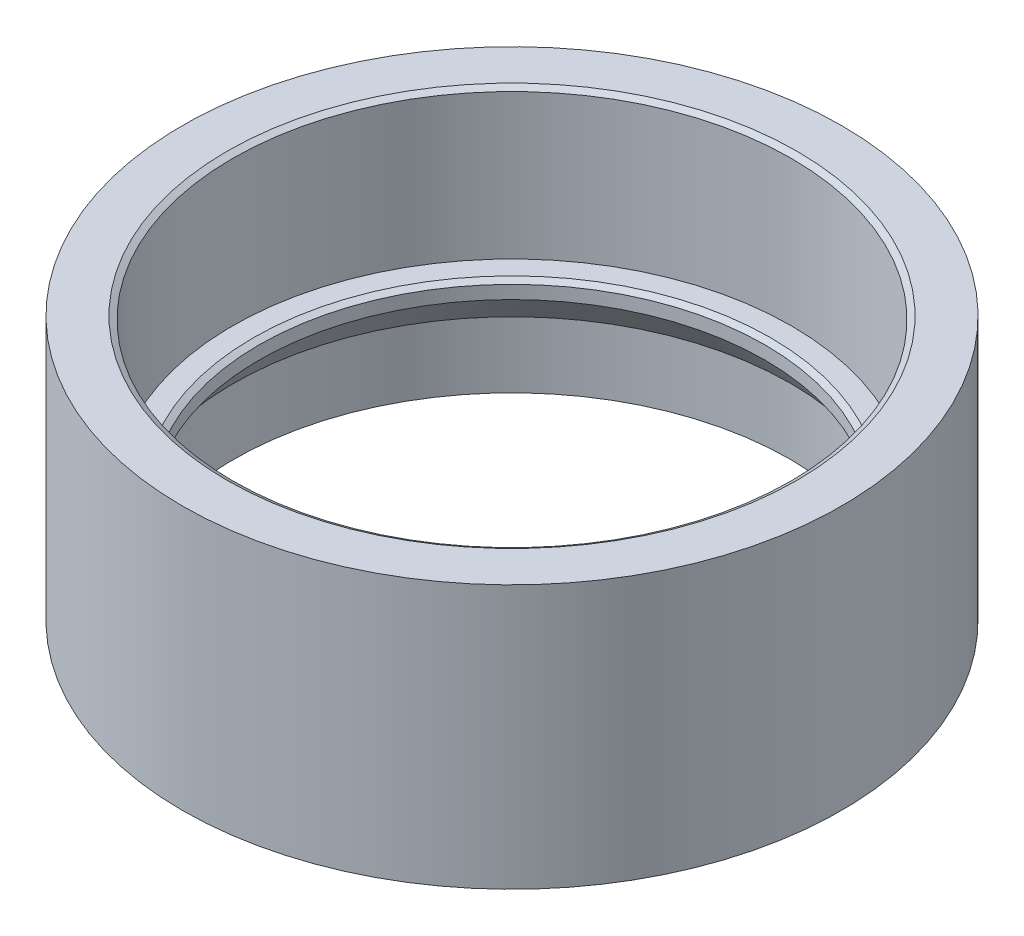
ISO-10303-21;
HEADER;
FILE_DESCRIPTION(('STEP AP214'),'2;1');
FILE_NAME('part.step','',(''),(''),'','','');
FILE_SCHEMA(('AUTOMOTIVE_DESIGN { 1 0 10303 214 1 1 1 1 }'));
ENDSEC;
DATA;
#1=APPLICATION_CONTEXT('core data for automotive mechanical design processes');
#2=APPLICATION_PROTOCOL_DEFINITION('international standard','automotive_design',2000,#1);
#3=PRODUCT_CONTEXT('',#1,'mechanical');
#4=PRODUCT('Part','Part','',(#3));
#5=PRODUCT_RELATED_PRODUCT_CATEGORY('part','',(#4));
#6=PRODUCT_DEFINITION_FORMATION('','',#4);
#7=PRODUCT_DEFINITION_CONTEXT('part definition',#1,'design');
#8=PRODUCT_DEFINITION('design','',#6,#7);
#9=PRODUCT_DEFINITION_SHAPE('','',#8);
#10=(LENGTH_UNIT() NAMED_UNIT(*) SI_UNIT(.MILLI.,.METRE.));
#11=(NAMED_UNIT(*) PLANE_ANGLE_UNIT() SI_UNIT($,.RADIAN.));
#12=(NAMED_UNIT(*) SI_UNIT($,.STERADIAN.) SOLID_ANGLE_UNIT());
#13=UNCERTAINTY_MEASURE_WITH_UNIT(LENGTH_MEASURE(1.E-05),#10,'distance_accuracy_value','');
#14=(GEOMETRIC_REPRESENTATION_CONTEXT(3) GLOBAL_UNCERTAINTY_ASSIGNED_CONTEXT((#13)) GLOBAL_UNIT_ASSIGNED_CONTEXT((#10,
#11,#12)) REPRESENTATION_CONTEXT('',''));
#15=CARTESIAN_POINT('',(0.,0.,0.));
#16=DIRECTION('',(0.,0.,1.));
#17=DIRECTION('',(1.,0.,0.));
#18=AXIS2_PLACEMENT_3D('',#15,#16,#17);
#19=CARTESIAN_POINT('',(89.9,0.,0.));
#20=DIRECTION('',(0.,-1.,0.));
#21=DIRECTION('',(0.,0.,-1.));
#22=AXIS2_PLACEMENT_3D('',#19,#20,#21);
#23=PLANE('',#22);
#24=CARTESIAN_POINT('',(0.,0.,0.));
#25=DIRECTION('',(0.,-1.,0.));
#26=DIRECTION('',(0.,0.,-1.));
#27=AXIS2_PLACEMENT_3D('',#24,#25,#26);
#28=CIRCLE('',#27,88.9);
#29=CARTESIAN_POINT('',(0.,0.,-88.9));
#30=VERTEX_POINT('',#29);
#31=EDGE_CURVE('E48',#30,#30,#28,.T.);
#32=ORIENTED_EDGE('',*,*,#31,.T.);
#33=EDGE_LOOP('',(#32));
#34=FACE_BOUND('',#33,.T.);
#35=CARTESIAN_POINT('',(0.,0.,0.));
#36=DIRECTION('',(0.,-1.,0.));
#37=DIRECTION('',(0.,0.,-1.));
#38=AXIS2_PLACEMENT_3D('',#35,#36,#37);
#39=CIRCLE('',#38,84.5);
#40=CARTESIAN_POINT('',(0.,0.,-84.5));
#41=VERTEX_POINT('',#40);
#42=EDGE_CURVE('E73',#41,#41,#39,.T.);
#43=ORIENTED_EDGE('',*,*,#42,.F.);
#44=EDGE_LOOP('',(#43));
#45=FACE_BOUND('',#44,.T.);
#46=ADVANCED_FACE('F41',(#34,#45),#23,.T.);
#47=CARTESIAN_POINT('',(0.,0.,0.));
#48=DIRECTION('',(0.,-1.,0.));
#49=DIRECTION('',(0.,0.,-1.));
#50=AXIS2_PLACEMENT_3D('',#47,#48,#49);
#51=CYLINDRICAL_SURFACE('',#50,84.5);
#52=ORIENTED_EDGE('',*,*,#42,.T.);
#53=EDGE_LOOP('',(#52));
#54=FACE_BOUND('',#53,.T.);
#55=CARTESIAN_POINT('',(0.,20.,0.));
#56=DIRECTION('',(0.,-1.,0.));
#57=DIRECTION('',(0.,0.,-1.));
#58=AXIS2_PLACEMENT_3D('',#55,#56,#57);
#59=CIRCLE('',#58,84.5);
#60=CARTESIAN_POINT('',(0.,20.,-84.5));
#61=VERTEX_POINT('',#60);
#62=EDGE_CURVE('E76',#61,#61,#59,.T.);
#63=ORIENTED_EDGE('',*,*,#62,.F.);
#64=EDGE_LOOP('',(#63));
#65=FACE_BOUND('',#64,.T.);
#66=ADVANCED_FACE('F114',(#54,#65),#51,.F.);
#67=CARTESIAN_POINT('',(0.,29.9984444867935,0.));
#68=DIRECTION('',(0.,-1.,0.));
#69=DIRECTION('',(0.,0.,-1.));
#70=AXIS2_PLACEMENT_3D('',#67,#68,#69);
#71=CONICAL_SURFACE('',#70,76.75,0.65938539140346);
#72=ORIENTED_EDGE('',*,*,#62,.T.);
#73=EDGE_LOOP('',(#72));
#74=FACE_BOUND('',#73,.T.);
#75=CARTESIAN_POINT('',(0.,29.9984444867935,0.));
#76=DIRECTION('',(0.,-1.,0.));
#77=DIRECTION('',(0.,0.,-1.));
#78=AXIS2_PLACEMENT_3D('',#75,#76,#77);
#79=CIRCLE('',#78,76.75);
#80=CARTESIAN_POINT('',(0.,29.9984444867935,-76.75));
#81=VERTEX_POINT('',#80);
#82=EDGE_CURVE('E79',#81,#81,#79,.T.);
#83=ORIENTED_EDGE('',*,*,#82,.F.);
#84=EDGE_LOOP('',(#83));
#85=FACE_BOUND('',#84,.T.);
#86=ADVANCED_FACE('F118',(#74,#85),#71,.F.);
#87=CARTESIAN_POINT('',(0.,0.,0.));
#88=DIRECTION('',(0.,-1.,0.));
#89=DIRECTION('',(0.,0.,-1.));
#90=AXIS2_PLACEMENT_3D('',#87,#88,#89);
#91=CYLINDRICAL_SURFACE('',#90,76.75);
#92=CARTESIAN_POINT('',(0.,33.9984444867934,0.));
#93=DIRECTION('',(0.,1.,0.));
#94=DIRECTION('',(0.,0.,1.));
#95=AXIS2_PLACEMENT_3D('',#92,#93,#94);
#96=CIRCLE('',#95,76.75);
#97=CARTESIAN_POINT('',(0.,33.9984444867934,76.75));
#98=VERTEX_POINT('',#97);
#99=EDGE_CURVE('E61',#98,#98,#96,.T.);
#100=ORIENTED_EDGE('',*,*,#99,.T.);
#101=EDGE_LOOP('',(#100));
#102=FACE_BOUND('',#101,.T.);
#103=ORIENTED_EDGE('',*,*,#82,.T.);
#104=EDGE_LOOP('',(#103));
#105=FACE_BOUND('',#104,.T.);
#106=ADVANCED_FACE('F172',(#102,#105),#91,.F.);
#107=CARTESIAN_POINT('',(76.75,34.9984444867935,0.));
#108=DIRECTION('',(0.,1.,0.));
#109=DIRECTION('',(0.,0.,1.));
#110=AXIS2_PLACEMENT_3D('',#107,#108,#109);
#111=PLANE('',#110);
#112=CARTESIAN_POINT('',(0.,34.9984444867935,0.));
#113=DIRECTION('',(0.,1.,0.));
#114=DIRECTION('',(0.,0.,1.));
#115=AXIS2_PLACEMENT_3D('',#112,#113,#114);
#116=CIRCLE('',#115,78.4820508075688);
#117=CARTESIAN_POINT('',(0.,34.9984444867935,78.4820508075688));
#118=VERTEX_POINT('',#117);
#119=EDGE_CURVE('E64',#118,#118,#116,.F.);
#120=ORIENTED_EDGE('',*,*,#119,.T.);
#121=EDGE_LOOP('',(#120));
#122=FACE_BOUND('',#121,.T.);
#123=CARTESIAN_POINT('',(0.,34.9984444867935,0.));
#124=DIRECTION('',(0.,-1.,0.));
#125=DIRECTION('',(0.,0.,-1.));
#126=AXIS2_PLACEMENT_3D('',#123,#124,#125);
#127=CIRCLE('',#126,84.75);
#128=CARTESIAN_POINT('',(0.,34.9984444867935,-84.75));
#129=VERTEX_POINT('',#128);
#130=EDGE_CURVE('E82',#129,#129,#127,.T.);
#131=ORIENTED_EDGE('',*,*,#130,.F.);
#132=EDGE_LOOP('',(#131));
#133=FACE_BOUND('',#132,.T.);
#134=ADVANCED_FACE('F168',(#122,#133),#111,.T.);
#135=CARTESIAN_POINT('',(0.,0.,0.));
#136=DIRECTION('',(0.,-1.,0.));
#137=DIRECTION('',(0.,0.,-1.));
#138=AXIS2_PLACEMENT_3D('',#135,#136,#137);
#139=CYLINDRICAL_SURFACE('',#138,84.75);
#140=CARTESIAN_POINT('',(0.,79.,0.));
#141=DIRECTION('',(0.,1.,0.));
#142=DIRECTION('',(0.,0.,1.));
#143=AXIS2_PLACEMENT_3D('',#140,#141,#142);
#144=CIRCLE('',#143,84.75);
#145=CARTESIAN_POINT('',(0.,79.,84.75));
#146=VERTEX_POINT('',#145);
#147=EDGE_CURVE('E67',#146,#146,#144,.T.);
#148=ORIENTED_EDGE('',*,*,#147,.T.);
#149=EDGE_LOOP('',(#148));
#150=FACE_BOUND('',#149,.T.);
#151=ORIENTED_EDGE('',*,*,#130,.T.);
#152=EDGE_LOOP('',(#151));
#153=FACE_BOUND('',#152,.T.);
#154=ADVANCED_FACE('F162',(#150,#153),#139,.F.);
#155=CARTESIAN_POINT('',(84.75,80.,0.));
#156=DIRECTION('',(0.,1.,0.));
#157=DIRECTION('',(0.,0.,1.));
#158=AXIS2_PLACEMENT_3D('',#155,#156,#157);
#159=PLANE('',#158);
#160=CARTESIAN_POINT('',(0.,80.,0.));
#161=DIRECTION('',(0.,1.,0.));
#162=DIRECTION('',(0.,0.,1.));
#163=AXIS2_PLACEMENT_3D('',#160,#161,#162);
#164=CIRCLE('',#163,86.4820508075689);
#165=CARTESIAN_POINT('',(0.,80.,86.4820508075689));
#166=VERTEX_POINT('',#165);
#167=EDGE_CURVE('E70',#166,#166,#164,.F.);
#168=ORIENTED_EDGE('',*,*,#167,.T.);
#169=EDGE_LOOP('',(#168));
#170=FACE_BOUND('',#169,.T.);
#171=CARTESIAN_POINT('',(0.,80.,0.));
#172=DIRECTION('',(0.,-1.,0.));
#173=DIRECTION('',(0.,0.,-1.));
#174=AXIS2_PLACEMENT_3D('',#171,#172,#173);
#175=CIRCLE('',#174,100.);
#176=CARTESIAN_POINT('',(0.,80.,-100.));
#177=VERTEX_POINT('',#176);
#178=EDGE_CURVE('E85',#177,#177,#175,.T.);
#179=ORIENTED_EDGE('',*,*,#178,.F.);
#180=EDGE_LOOP('',(#179));
#181=FACE_BOUND('',#180,.T.);
#182=ADVANCED_FACE('F157',(#170,#181),#159,.T.);
#183=CARTESIAN_POINT('',(0.,0.,0.));
#184=DIRECTION('',(0.,-1.,0.));
#185=DIRECTION('',(0.,0.,-1.));
#186=AXIS2_PLACEMENT_3D('',#183,#184,#185);
#187=CYLINDRICAL_SURFACE('',#186,100.);
#188=ORIENTED_EDGE('',*,*,#178,.T.);
#189=EDGE_LOOP('',(#188));
#190=FACE_BOUND('',#189,.T.);
#191=CARTESIAN_POINT('',(0.,0.,0.));
#192=DIRECTION('',(0.,-1.,0.));
#193=DIRECTION('',(0.,0.,-1.));
#194=AXIS2_PLACEMENT_3D('',#191,#192,#193);
#195=CIRCLE('',#194,100.);
#196=CARTESIAN_POINT('',(0.,0.,-100.));
#197=VERTEX_POINT('',#196);
#198=EDGE_CURVE('E88',#197,#197,#195,.T.);
#199=ORIENTED_EDGE('',*,*,#198,.F.);
#200=EDGE_LOOP('',(#199));
#201=FACE_BOUND('',#200,.T.);
#202=ADVANCED_FACE('F152',(#190,#201),#187,.T.);
#203=CARTESIAN_POINT('',(100.,0.,0.));
#204=DIRECTION('',(0.,-1.,0.));
#205=DIRECTION('',(0.,0.,-1.));
#206=AXIS2_PLACEMENT_3D('',#203,#204,#205);
#207=PLANE('',#206);
#208=CARTESIAN_POINT('',(0.,0.,0.));
#209=DIRECTION('',(0.,-1.,0.));
#210=DIRECTION('',(0.,0.,-1.));
#211=AXIS2_PLACEMENT_3D('',#208,#209,#210);
#212=CIRCLE('',#211,96.);
#213=CARTESIAN_POINT('',(0.,0.,-96.));
#214=VERTEX_POINT('',#213);
#215=EDGE_CURVE('E52',#214,#214,#212,.F.);
#216=ORIENTED_EDGE('',*,*,#215,.T.);
#217=EDGE_LOOP('',(#216));
#218=FACE_BOUND('',#217,.T.);
#219=ORIENTED_EDGE('',*,*,#198,.T.);
#220=EDGE_LOOP('',(#219));
#221=FACE_BOUND('',#220,.T.);
#222=ADVANCED_FACE('F110',(#218,#221),#207,.T.);
#223=CARTESIAN_POINT('',(0.,0.,0.));
#224=DIRECTION('',(0.,-1.,0.));
#225=DIRECTION('',(0.,0.,-1.));
#226=AXIS2_PLACEMENT_3D('',#223,#224,#225);
#227=CYLINDRICAL_SURFACE('',#226,95.);
#228=CARTESIAN_POINT('',(0.,1.,0.));
#229=DIRECTION('',(0.,-1.,0.));
#230=DIRECTION('',(0.,0.,-1.));
#231=AXIS2_PLACEMENT_3D('',#228,#229,#230);
#232=CIRCLE('',#231,95.);
#233=CARTESIAN_POINT('',(0.,1.,-95.));
#234=VERTEX_POINT('',#233);
#235=EDGE_CURVE('E56',#234,#234,#232,.T.);
#236=ORIENTED_EDGE('',*,*,#235,.T.);
#237=EDGE_LOOP('',(#236));
#238=FACE_BOUND('',#237,.T.);
#239=CARTESIAN_POINT('',(0.,5.,0.));
#240=DIRECTION('',(0.,-1.,0.));
#241=DIRECTION('',(0.,0.,-1.));
#242=AXIS2_PLACEMENT_3D('',#239,#240,#241);
#243=CIRCLE('',#242,95.);
#244=CARTESIAN_POINT('',(0.,5.,-95.));
#245=VERTEX_POINT('',#244);
#246=EDGE_CURVE('E91',#245,#245,#243,.T.);
#247=ORIENTED_EDGE('',*,*,#246,.F.);
#248=EDGE_LOOP('',(#247));
#249=FACE_BOUND('',#248,.T.);
#250=ADVANCED_FACE('F102',(#238,#249),#227,.F.);
#251=CARTESIAN_POINT('',(89.9,5.,0.));
#252=DIRECTION('',(0.,-1.,0.));
#253=DIRECTION('',(0.,0.,-1.));
#254=AXIS2_PLACEMENT_3D('',#251,#252,#253);
#255=PLANE('',#254);
#256=ORIENTED_EDGE('',*,*,#246,.T.);
#257=EDGE_LOOP('',(#256));
#258=FACE_BOUND('',#257,.T.);
#259=CARTESIAN_POINT('',(0.,5.,0.));
#260=DIRECTION('',(0.,-1.,0.));
#261=DIRECTION('',(0.,0.,-1.));
#262=AXIS2_PLACEMENT_3D('',#259,#260,#261);
#263=CIRCLE('',#262,89.9);
#264=CARTESIAN_POINT('',(0.,5.,-89.9));
#265=VERTEX_POINT('',#264);
#266=EDGE_CURVE('E94',#265,#265,#263,.T.);
#267=ORIENTED_EDGE('',*,*,#266,.F.);
#268=EDGE_LOOP('',(#267));
#269=FACE_BOUND('',#268,.T.);
#270=ADVANCED_FACE('F100',(#258,#269),#255,.T.);
#271=CARTESIAN_POINT('',(0.,0.,0.));
#272=DIRECTION('',(0.,-1.,0.));
#273=DIRECTION('',(0.,0.,-1.));
#274=AXIS2_PLACEMENT_3D('',#271,#272,#273);
#275=CYLINDRICAL_SURFACE('',#274,89.9);
#276=CARTESIAN_POINT('',(0.,1.,0.));
#277=DIRECTION('',(0.,-1.,0.));
#278=DIRECTION('',(0.,0.,-1.));
#279=AXIS2_PLACEMENT_3D('',#276,#277,#278);
#280=CIRCLE('',#279,89.9);
#281=CARTESIAN_POINT('',(0.,1.,-89.9));
#282=VERTEX_POINT('',#281);
#283=EDGE_CURVE('E10',#282,#282,#280,.F.);
#284=ORIENTED_EDGE('',*,*,#283,.T.);
#285=EDGE_LOOP('',(#284));
#286=FACE_BOUND('',#285,.T.);
#287=ORIENTED_EDGE('',*,*,#266,.T.);
#288=EDGE_LOOP('',(#287));
#289=FACE_BOUND('',#288,.T.);
#290=ADVANCED_FACE('F98',(#286,#289),#275,.T.);
#291=CARTESIAN_POINT('',(0.,80.,0.));
#292=DIRECTION('',(0.,1.,0.));
#293=DIRECTION('',(0.,0.,1.));
#294=AXIS2_PLACEMENT_3D('',#291,#292,#293);
#295=CONICAL_SURFACE('',#294,86.4820508075689,1.04719755119659);
#296=ORIENTED_EDGE('',*,*,#147,.F.);
#297=EDGE_LOOP('',(#296));
#298=FACE_BOUND('',#297,.T.);
#299=ORIENTED_EDGE('',*,*,#167,.F.);
#300=EDGE_LOOP('',(#299));
#301=FACE_BOUND('',#300,.T.);
#302=ADVANCED_FACE('F108',(#298,#301),#295,.F.);
#303=CARTESIAN_POINT('',(0.,34.9984444867935,0.));
#304=DIRECTION('',(0.,1.,0.));
#305=DIRECTION('',(0.,0.,1.));
#306=AXIS2_PLACEMENT_3D('',#303,#304,#305);
#307=CONICAL_SURFACE('',#306,78.4820508075688,1.04719755119659);
#308=ORIENTED_EDGE('',*,*,#99,.F.);
#309=EDGE_LOOP('',(#308));
#310=FACE_BOUND('',#309,.T.);
#311=ORIENTED_EDGE('',*,*,#119,.F.);
#312=EDGE_LOOP('',(#311));
#313=FACE_BOUND('',#312,.T.);
#314=ADVANCED_FACE('F130',(#310,#313),#307,.F.);
#315=CARTESIAN_POINT('',(0.,1.,0.));
#316=DIRECTION('',(0.,-1.,0.));
#317=DIRECTION('',(0.,0.,-1.));
#318=AXIS2_PLACEMENT_3D('',#315,#316,#317);
#319=TOROIDAL_SURFACE('',#318,96.,1.);
#320=ORIENTED_EDGE('',*,*,#215,.F.);
#321=EDGE_LOOP('',(#320));
#322=FACE_BOUND('',#321,.T.);
#323=ORIENTED_EDGE('',*,*,#235,.F.);
#324=EDGE_LOOP('',(#323));
#325=FACE_BOUND('',#324,.T.);
#326=ADVANCED_FACE('F135',(#322,#325),#319,.T.);
#327=CARTESIAN_POINT('',(0.,1.,0.));
#328=DIRECTION('',(0.,-1.,0.));
#329=DIRECTION('',(0.,0.,-1.));
#330=AXIS2_PLACEMENT_3D('',#327,#328,#329);
#331=TOROIDAL_SURFACE('',#330,88.9,1.);
#332=ORIENTED_EDGE('',*,*,#283,.F.);
#333=EDGE_LOOP('',(#332));
#334=FACE_BOUND('',#333,.T.);
#335=ORIENTED_EDGE('',*,*,#31,.F.);
#336=EDGE_LOOP('',(#335));
#337=FACE_BOUND('',#336,.T.);
#338=ADVANCED_FACE('F43',(#334,#337),#331,.T.);
#339=CLOSED_SHELL('',(#46,#66,#86,#106,#134,#154,#182,#202,#222,#250,#270,#290,#302,#314,#326,#338));
#340=MANIFOLD_SOLID_BREP('B2',#339);
#341=ADVANCED_BREP_SHAPE_REPRESENTATION('',(#18,#340),#14);
#342=SHAPE_DEFINITION_REPRESENTATION(#9,#341);
ENDSEC;
END-ISO-10303-21;
